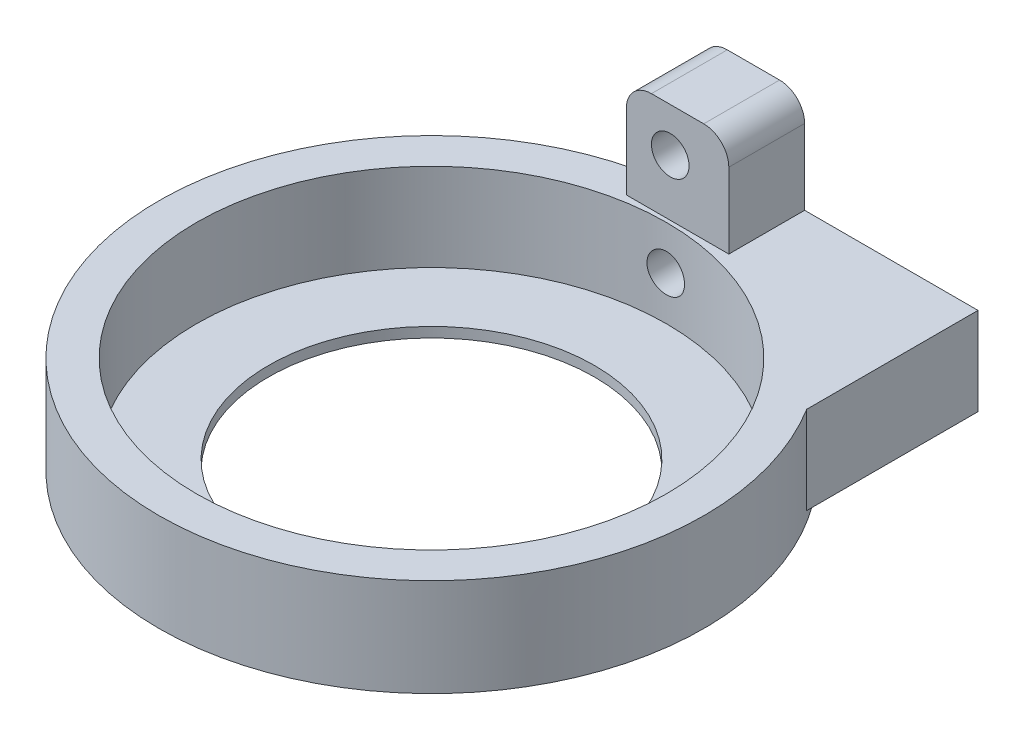
ISO-10303-21;
HEADER;
FILE_DESCRIPTION(('STEP AP214'),'2;1');
FILE_NAME('part.step','',(''),(''),'','','');
FILE_SCHEMA(('AUTOMOTIVE_DESIGN { 1 0 10303 214 1 1 1 1 }'));
ENDSEC;
DATA;
#1=APPLICATION_CONTEXT('core data for automotive mechanical design processes');
#2=APPLICATION_PROTOCOL_DEFINITION('international standard','automotive_design',2000,#1);
#3=PRODUCT_CONTEXT('',#1,'mechanical');
#4=PRODUCT('Part','Part','',(#3));
#5=PRODUCT_RELATED_PRODUCT_CATEGORY('part','',(#4));
#6=PRODUCT_DEFINITION_FORMATION('','',#4);
#7=PRODUCT_DEFINITION_CONTEXT('part definition',#1,'design');
#8=PRODUCT_DEFINITION('design','',#6,#7);
#9=PRODUCT_DEFINITION_SHAPE('','',#8);
#10=(LENGTH_UNIT() NAMED_UNIT(*) SI_UNIT(.MILLI.,.METRE.));
#11=(NAMED_UNIT(*) PLANE_ANGLE_UNIT() SI_UNIT($,.RADIAN.));
#12=(NAMED_UNIT(*) SI_UNIT($,.STERADIAN.) SOLID_ANGLE_UNIT());
#13=UNCERTAINTY_MEASURE_WITH_UNIT(LENGTH_MEASURE(1.E-05),#10,'distance_accuracy_value','');
#14=(GEOMETRIC_REPRESENTATION_CONTEXT(3) GLOBAL_UNCERTAINTY_ASSIGNED_CONTEXT((#13)) GLOBAL_UNIT_ASSIGNED_CONTEXT((#10,
#11,#12)) REPRESENTATION_CONTEXT('',''));
#15=CARTESIAN_POINT('',(0.,0.,0.));
#16=DIRECTION('',(0.,0.,1.));
#17=DIRECTION('',(1.,0.,0.));
#18=AXIS2_PLACEMENT_3D('',#15,#16,#17);
#19=CARTESIAN_POINT('',(0.,0.,0.));
#20=DIRECTION('',(0.,1.,0.));
#21=DIRECTION('',(0.,0.,-1.));
#22=AXIS2_PLACEMENT_3D('',#19,#20,#21);
#23=PLANE('',#22);
#24=CARTESIAN_POINT('',(0.,0.,0.));
#25=DIRECTION('',(0.,1.,0.));
#26=DIRECTION('',(0.,0.,1.));
#27=AXIS2_PLACEMENT_3D('',#24,#25,#26);
#28=CIRCLE('',#27,21.75);
#29=CARTESIAN_POINT('',(18.5,0.,-11.4373292336979));
#30=VERTEX_POINT('',#29);
#31=CARTESIAN_POINT('',(-3.5,0.,-21.4665437367081));
#32=VERTEX_POINT('',#31);
#33=EDGE_CURVE('E163',#30,#32,#28,.T.);
#34=ORIENTED_EDGE('',*,*,#33,.T.);
#35=DIRECTION('',(0.,0.,1.));
#36=VECTOR('',#35,1.);
#37=CARTESIAN_POINT('',(-3.5,0.,-25.1));
#38=LINE('',#37,#36);
#39=CARTESIAN_POINT('',(-3.5,0.,-25.1));
#40=VERTEX_POINT('',#39);
#41=EDGE_CURVE('E178',#40,#32,#38,.T.);
#42=ORIENTED_EDGE('',*,*,#41,.F.);
#43=DIRECTION('',(-1.,0.,0.));
#44=VECTOR('',#43,1.);
#45=CARTESIAN_POINT('',(3.5,0.,-25.1));
#46=LINE('',#45,#44);
#47=CARTESIAN_POINT('',(18.5,0.,-25.1));
#48=VERTEX_POINT('',#47);
#49=EDGE_CURVE('E185',#48,#40,#46,.T.);
#50=ORIENTED_EDGE('',*,*,#49,.F.);
#51=DIRECTION('',(0.,0.,1.));
#52=VECTOR('',#51,1.);
#53=CARTESIAN_POINT('',(18.5,0.,-25.1));
#54=LINE('',#53,#52);
#55=EDGE_CURVE('E154',#48,#30,#54,.T.);
#56=ORIENTED_EDGE('',*,*,#55,.T.);
#57=EDGE_LOOP('',(#34,#42,#50,#56));
#58=FACE_BOUND('',#57,.T.);
#59=ADVANCED_FACE('F41',(#58),#23,.F.);
#60=CARTESIAN_POINT('',(0.,7.,0.));
#61=DIRECTION('',(0.,1.,0.));
#62=DIRECTION('',(0.,0.,-1.));
#63=AXIS2_PLACEMENT_3D('',#60,#61,#62);
#64=PLANE('',#63);
#65=DIRECTION('',(0.,0.,-1.));
#66=VECTOR('',#65,1.);
#67=CARTESIAN_POINT('',(-3.5,7.,-25.1));
#68=LINE('',#67,#66);
#69=CARTESIAN_POINT('',(-3.5,7.,-19.0497576098352));
#70=VERTEX_POINT('',#69);
#71=CARTESIAN_POINT('',(-3.5,7.,-21.4665437367081));
#72=VERTEX_POINT('',#71);
#73=EDGE_CURVE('E135',#70,#72,#68,.T.);
#74=ORIENTED_EDGE('',*,*,#73,.T.);
#75=CARTESIAN_POINT('',(0.,7.,0.));
#76=DIRECTION('',(0.,-1.,0.));
#77=DIRECTION('',(0.,0.,-1.));
#78=AXIS2_PLACEMENT_3D('',#75,#76,#77);
#79=CIRCLE('',#78,21.75);
#80=CARTESIAN_POINT('',(18.5,7.,-11.4373292336979));
#81=VERTEX_POINT('',#80);
#82=EDGE_CURVE('E182',#81,#72,#79,.T.);
#83=ORIENTED_EDGE('',*,*,#82,.F.);
#84=DIRECTION('',(0.,0.,-1.));
#85=VECTOR('',#84,1.);
#86=CARTESIAN_POINT('',(18.5,7.,-25.1));
#87=LINE('',#86,#85);
#88=CARTESIAN_POINT('',(18.5,7.,-25.1));
#89=VERTEX_POINT('',#88);
#90=EDGE_CURVE('E157',#81,#89,#87,.T.);
#91=ORIENTED_EDGE('',*,*,#90,.T.);
#92=DIRECTION('',(-1.,0.,0.));
#93=VECTOR('',#92,1.);
#94=CARTESIAN_POINT('',(3.5,7.,-25.1));
#95=LINE('',#94,#93);
#96=CARTESIAN_POINT('',(4.67120690078326,7.,-25.1));
#97=VERTEX_POINT('',#96);
#98=EDGE_CURVE('E134',#89,#97,#95,.T.);
#99=ORIENTED_EDGE('',*,*,#98,.T.);
#100=DIRECTION('',(0.,0.,1.));
#101=VECTOR('',#100,1.);
#102=CARTESIAN_POINT('',(4.67120690078326,7.,-25.1));
#103=LINE('',#102,#101);
#104=CARTESIAN_POINT('',(4.67120690078326,7.,-19.0497576098352));
#105=VERTEX_POINT('',#104);
#106=EDGE_CURVE('E116',#97,#105,#103,.T.);
#107=ORIENTED_EDGE('',*,*,#106,.T.);
#108=DIRECTION('',(-1.,0.,0.));
#109=VECTOR('',#108,1.);
#110=CARTESIAN_POINT('',(-3.5,7.,-19.0497576098352));
#111=LINE('',#110,#109);
#112=EDGE_CURVE('E122',#105,#70,#111,.T.);
#113=ORIENTED_EDGE('',*,*,#112,.T.);
#114=EDGE_LOOP('',(#74,#83,#91,#99,#107,#113));
#115=FACE_BOUND('',#114,.T.);
#116=CARTESIAN_POINT('',(0.,7.,0.));
#117=DIRECTION('',(0.,-1.,0.));
#118=DIRECTION('',(0.,0.,-1.));
#119=AXIS2_PLACEMENT_3D('',#116,#117,#118);
#120=CIRCLE('',#119,18.75);
#121=CARTESIAN_POINT('',(0.,7.,-18.75));
#122=VERTEX_POINT('',#121);
#123=EDGE_CURVE('E175',#122,#122,#120,.T.);
#124=ORIENTED_EDGE('',*,*,#123,.T.);
#125=EDGE_LOOP('',(#124));
#126=FACE_BOUND('',#125,.T.);
#127=ADVANCED_FACE('F130',(#115,#126),#64,.T.);
#128=CARTESIAN_POINT('',(0.,7.,0.));
#129=DIRECTION('',(0.,-1.,0.));
#130=DIRECTION('',(0.,0.,1.));
#131=AXIS2_PLACEMENT_3D('',#128,#129,#130);
#132=CYLINDRICAL_SURFACE('',#131,21.75);
#133=ORIENTED_EDGE('',*,*,#82,.T.);
#134=DIRECTION('',(0.,-1.,0.));
#135=VECTOR('',#134,1.);
#136=CARTESIAN_POINT('',(-3.5,7.,-21.4665437367081));
#137=LINE('',#136,#135);
#138=EDGE_CURVE('E193',#72,#32,#137,.T.);
#139=ORIENTED_EDGE('',*,*,#138,.T.);
#140=ORIENTED_EDGE('',*,*,#33,.F.);
#141=DIRECTION('',(0.,1.,0.));
#142=VECTOR('',#141,1.);
#143=CARTESIAN_POINT('',(18.5,0.,-11.4373292336979));
#144=LINE('',#143,#142);
#145=EDGE_CURVE('E148',#30,#81,#144,.T.);
#146=ORIENTED_EDGE('',*,*,#145,.T.);
#147=EDGE_LOOP('',(#133,#139,#140,#146));
#148=FACE_BOUND('',#147,.T.);
#149=CARTESIAN_POINT('',(0.,-0.8,0.));
#150=DIRECTION('',(0.,1.,0.));
#151=DIRECTION('',(0.,0.,1.));
#152=AXIS2_PLACEMENT_3D('',#149,#150,#151);
#153=CIRCLE('',#152,21.75);
#154=CARTESIAN_POINT('',(0.,-0.8,21.75));
#155=VERTEX_POINT('',#154);
#156=EDGE_CURVE('E166',#155,#155,#153,.T.);
#157=ORIENTED_EDGE('',*,*,#156,.T.);
#158=EDGE_LOOP('',(#157));
#159=FACE_BOUND('',#158,.T.);
#160=ADVANCED_FACE('F215',(#148,#159),#132,.T.);
#161=CARTESIAN_POINT('',(-3.5,7.,-25.1));
#162=DIRECTION('',(-1.,0.,0.));
#163=DIRECTION('',(0.,0.,-1.));
#164=AXIS2_PLACEMENT_3D('',#161,#162,#163);
#165=PLANE('',#164);
#166=DIRECTION('',(0.,-1.,0.));
#167=VECTOR('',#166,1.);
#168=CARTESIAN_POINT('',(-3.5,7.,-25.1));
#169=LINE('',#168,#167);
#170=CARTESIAN_POINT('',(-3.5,13.,-25.1));
#171=VERTEX_POINT('',#170);
#172=EDGE_CURVE('E187',#171,#40,#169,.T.);
#173=ORIENTED_EDGE('',*,*,#172,.T.);
#174=ORIENTED_EDGE('',*,*,#41,.T.);
#175=ORIENTED_EDGE('',*,*,#138,.F.);
#176=ORIENTED_EDGE('',*,*,#73,.F.);
#177=DIRECTION('',(0.,-1.,0.));
#178=VECTOR('',#177,1.);
#179=CARTESIAN_POINT('',(-3.5,15.,-19.0497576098352));
#180=LINE('',#179,#178);
#181=CARTESIAN_POINT('',(-3.5,13.,-19.0497576098352));
#182=VERTEX_POINT('',#181);
#183=EDGE_CURVE('E119',#182,#70,#180,.T.);
#184=ORIENTED_EDGE('',*,*,#183,.F.);
#185=DIRECTION('',(0.,0.,-1.));
#186=VECTOR('',#185,1.);
#187=CARTESIAN_POINT('',(-3.5,13.,-19.0497576098352));
#188=LINE('',#187,#186);
#189=EDGE_CURVE('E242',#171,#182,#188,.F.);
#190=ORIENTED_EDGE('',*,*,#189,.F.);
#191=EDGE_LOOP('',(#173,#174,#175,#176,#184,#190));
#192=FACE_BOUND('',#191,.T.);
#193=ADVANCED_FACE('F221',(#192),#165,.T.);
#194=CARTESIAN_POINT('',(3.5,7.,-25.1));
#195=DIRECTION('',(0.,0.,-1.));
#196=DIRECTION('',(1.,0.,0.));
#197=AXIS2_PLACEMENT_3D('',#194,#195,#196);
#198=PLANE('',#197);
#199=CARTESIAN_POINT('',(0.,11.5,-25.1));
#200=DIRECTION('',(0.,0.,1.));
#201=DIRECTION('',(1.,0.,0.));
#202=AXIS2_PLACEMENT_3D('',#199,#200,#201);
#203=CIRCLE('',#202,1.5);
#204=CARTESIAN_POINT('',(1.5,11.5,-25.1));
#205=VERTEX_POINT('',#204);
#206=EDGE_CURVE('E248',#205,#205,#203,.T.);
#207=ORIENTED_EDGE('',*,*,#206,.T.);
#208=EDGE_LOOP('',(#207));
#209=FACE_BOUND('',#208,.T.);
#210=CARTESIAN_POINT('',(10.,3.5,-25.1));
#211=DIRECTION('',(0.,0.,1.));
#212=DIRECTION('',(1.,0.,0.));
#213=AXIS2_PLACEMENT_3D('',#210,#211,#212);
#214=CIRCLE('',#213,1.5);
#215=CARTESIAN_POINT('',(11.5,3.5,-25.1));
#216=VERTEX_POINT('',#215);
#217=EDGE_CURVE('E144',#216,#216,#214,.T.);
#218=ORIENTED_EDGE('',*,*,#217,.T.);
#219=EDGE_LOOP('',(#218));
#220=FACE_BOUND('',#219,.T.);
#221=DIRECTION('',(1.,0.,0.));
#222=VECTOR('',#221,1.);
#223=CARTESIAN_POINT('',(-3.5,15.,-25.1));
#224=LINE('',#223,#222);
#225=CARTESIAN_POINT('',(-1.5,15.,-25.1));
#226=VERTEX_POINT('',#225);
#227=CARTESIAN_POINT('',(2.67120690078326,15.,-25.1));
#228=VERTEX_POINT('',#227);
#229=EDGE_CURVE('E128',#226,#228,#224,.T.);
#230=ORIENTED_EDGE('',*,*,#229,.T.);
#231=CARTESIAN_POINT('',(2.67120690078326,13.,-25.1));
#232=DIRECTION('',(0.,0.,1.));
#233=DIRECTION('',(1.,0.,0.));
#234=AXIS2_PLACEMENT_3D('',#231,#232,#233);
#235=CIRCLE('',#234,2.);
#236=CARTESIAN_POINT('',(4.67120690078326,13.,-25.1));
#237=VERTEX_POINT('',#236);
#238=EDGE_CURVE('E491',#237,#228,#235,.T.);
#239=ORIENTED_EDGE('',*,*,#238,.F.);
#240=DIRECTION('',(0.,-1.,0.));
#241=VECTOR('',#240,1.);
#242=CARTESIAN_POINT('',(4.67120690078326,15.,-25.1));
#243=LINE('',#242,#241);
#244=EDGE_CURVE('E118',#237,#97,#243,.T.);
#245=ORIENTED_EDGE('',*,*,#244,.T.);
#246=ORIENTED_EDGE('',*,*,#98,.F.);
#247=DIRECTION('',(0.,-1.,0.));
#248=VECTOR('',#247,1.);
#249=CARTESIAN_POINT('',(18.5,7.,-25.1));
#250=LINE('',#249,#248);
#251=EDGE_CURVE('E152',#89,#48,#250,.T.);
#252=ORIENTED_EDGE('',*,*,#251,.T.);
#253=ORIENTED_EDGE('',*,*,#49,.T.);
#254=ORIENTED_EDGE('',*,*,#172,.F.);
#255=CARTESIAN_POINT('',(-1.5,13.,-25.1));
#256=DIRECTION('',(0.,0.,1.));
#257=DIRECTION('',(1.,0.,0.));
#258=AXIS2_PLACEMENT_3D('',#255,#256,#257);
#259=CIRCLE('',#258,2.);
#260=EDGE_CURVE('E487',#226,#171,#259,.T.);
#261=ORIENTED_EDGE('',*,*,#260,.F.);
#262=EDGE_LOOP('',(#230,#239,#245,#246,#252,#253,#254,#261));
#263=FACE_BOUND('',#262,.T.);
#264=CARTESIAN_POINT('',(0.,3.5,-25.1));
#265=DIRECTION('',(0.,0.,1.));
#266=DIRECTION('',(1.,0.,0.));
#267=AXIS2_PLACEMENT_3D('',#264,#265,#266);
#268=CIRCLE('',#267,1.5);
#269=CARTESIAN_POINT('',(1.5,3.5,-25.1));
#270=VERTEX_POINT('',#269);
#271=EDGE_CURVE('E169',#270,#270,#268,.T.);
#272=ORIENTED_EDGE('',*,*,#271,.T.);
#273=EDGE_LOOP('',(#272));
#274=FACE_BOUND('',#273,.T.);
#275=ADVANCED_FACE('F211',(#209,#220,#263,#274),#198,.T.);
#276=CARTESIAN_POINT('',(0.,7.,0.));
#277=DIRECTION('',(0.,-1.,0.));
#278=DIRECTION('',(0.,0.,1.));
#279=AXIS2_PLACEMENT_3D('',#276,#277,#278);
#280=CYLINDRICAL_SURFACE('',#279,18.75);
#281=CARTESIAN_POINT('',(1.5,3.5,-18.6899036915657));
#282=CARTESIAN_POINT('',(1.49999632062772,3.41588910974437,-18.6899044892014));
#283=CARTESIAN_POINT('',(1.49290156215183,3.3317206652062,-18.6904775942158));
#284=CARTESIAN_POINT('',(1.46470318774386,3.16571175768858,-18.6927081206783));
#285=CARTESIAN_POINT('',(1.44358362109166,3.08387405616433,-18.6943667767162));
#286=CARTESIAN_POINT('',(1.38794959023862,2.92495508136651,-18.6985793452206));
#287=CARTESIAN_POINT('',(1.35344262614257,2.84787117282067,-18.7011327563356));
#288=CARTESIAN_POINT('',(1.27202646042832,2.70060821925846,-18.7068465005001));
#289=CARTESIAN_POINT('',(1.22511994393665,2.630427683824,-18.7100067021084));
#290=CARTESIAN_POINT('',(1.12011551831489,2.49877819168836,-18.7165863916315));
#291=CARTESIAN_POINT('',(1.06199424933048,2.43732789187484,-18.7200064115608));
#292=CARTESIAN_POINT('',(0.936259445760343,2.32504341460093,-18.7267155033906));
#293=CARTESIAN_POINT('',(0.868645500088394,2.27420969713547,-18.7300045696121));
#294=CARTESIAN_POINT('',(0.725734168475946,2.18453992472742,-18.7360861453358));
#295=CARTESIAN_POINT('',(0.650426681655086,2.14571991903267,-18.738877988498));
#296=CARTESIAN_POINT('',(0.494336491088885,2.08128219450257,-18.7436448358792));
#297=CARTESIAN_POINT('',(0.413553876517281,2.05566426070272,-18.745619853398));
#298=CARTESIAN_POINT('',(0.248991495760869,2.01841132760336,-18.7485268054688));
#299=CARTESIAN_POINT('',(0.165218575252358,2.00674626571047,-18.7494609822974));
#300=CARTESIAN_POINT('',(-0.00310101422522166,1.99763728747693,-18.7501885880184));
#301=CARTESIAN_POINT('',(-0.0876476697940369,2.00019312530925,-18.7499820366297));
#302=CARTESIAN_POINT('',(-0.254910958845742,2.01942877416144,-18.7484533122186));
#303=CARTESIAN_POINT('',(-0.337631336820587,2.03607625616637,-18.7471336928186));
#304=CARTESIAN_POINT('',(-0.499099950189813,2.08297238129014,-18.7435302217384));
#305=CARTESIAN_POINT('',(-0.577848150305161,2.11322114518559,-18.7412463614959));
#306=CARTESIAN_POINT('',(-0.729240075628612,2.18649731782168,-18.7359669873138));
#307=CARTESIAN_POINT('',(-0.801876748665349,2.22953923615441,-18.7329706660993));
#308=CARTESIAN_POINT('',(-0.938906754389632,2.32716937813201,-18.7266031809033));
#309=CARTESIAN_POINT('',(-1.00329993315168,2.38175781732721,-18.7232320099247));
#310=CARTESIAN_POINT('',(-1.12220402922705,2.50111371219672,-18.716482638835));
#311=CARTESIAN_POINT('',(-1.17668675797546,2.56590925405083,-18.7131044454878));
#312=CARTESIAN_POINT('',(-1.27400569041641,2.70374207490187,-18.7067312907922));
#313=CARTESIAN_POINT('',(-1.31684188556444,2.77677935994532,-18.7037363297249));
#314=CARTESIAN_POINT('',(-1.38965054864154,2.92904186429338,-18.6984681334495));
#315=CARTESIAN_POINT('',(-1.41962160308561,3.00826776240737,-18.6961949775527));
#316=CARTESIAN_POINT('',(-1.46582859989257,3.17064933913142,-18.6926292502436));
#317=CARTESIAN_POINT('',(-1.48206480809471,3.25380494164879,-18.6913366598524));
#318=CARTESIAN_POINT('',(-1.50030564278629,3.4214389223715,-18.6898814380755));
#319=CARTESIAN_POINT('',(-1.50234955607957,3.50591299971711,-18.6897156874231));
#320=CARTESIAN_POINT('',(-1.49225064585172,3.67400262104635,-18.690524676209));
#321=CARTESIAN_POINT('',(-1.48010794413208,3.75761817239478,-18.6914994058556));
#322=CARTESIAN_POINT('',(-1.44201322164018,3.92150472101421,-18.6944766801575));
#323=CARTESIAN_POINT('',(-1.41607949196744,4.00177999680187,-18.6964778632987));
#324=CARTESIAN_POINT('',(-1.35115745890298,4.15683972413565,-18.7012814234103));
#325=CARTESIAN_POINT('',(-1.31216896221481,4.23162409436024,-18.7040838122436));
#326=CARTESIAN_POINT('',(-1.22214454706965,4.373759059463,-18.7101815822911));
#327=CARTESIAN_POINT('',(-1.17108242281578,4.44109300986021,-18.7134780300796));
#328=CARTESIAN_POINT('',(-1.05839811840015,4.5662476479122,-18.7201888557784));
#329=CARTESIAN_POINT('',(-0.996775770633618,4.62406818454792,-18.7236032355598));
#330=CARTESIAN_POINT('',(-0.864550602263586,4.72868853250665,-18.7301744660023));
#331=CARTESIAN_POINT('',(-0.793927565253147,4.77546283652398,-18.7333307098241));
#332=CARTESIAN_POINT('',(-0.645806640765806,4.85648803992158,-18.7390213036078));
#333=CARTESIAN_POINT('',(-0.568308817352759,4.89073905598699,-18.7415556593639));
#334=CARTESIAN_POINT('',(-0.408730022480179,4.94570151548968,-18.7457141148762));
#335=CARTESIAN_POINT('',(-0.326654535286603,4.96642879824313,-18.7473392791795));
#336=CARTESIAN_POINT('',(-0.160174833719194,4.99380720003187,-18.7495005498768));
#337=CARTESIAN_POINT('',(-0.0757706596510529,5.00045856254326,-18.7500366751083));
#338=CARTESIAN_POINT('',(0.0927188866521085,4.99949357241986,-18.7499594956931));
#339=CARTESIAN_POINT('',(0.176804491059185,4.99191700058234,-18.7493493958487));
#340=CARTESIAN_POINT('',(0.342505049325764,4.96279408533884,-18.7470546664287));
#341=CARTESIAN_POINT('',(0.424119999621,4.94124772178048,-18.7453700353031));
#342=CARTESIAN_POINT('',(0.58256563894844,4.88480677611825,-18.7411153164152));
#343=CARTESIAN_POINT('',(0.6593965525984,4.8499128212543,-18.7385452702617));
#344=CARTESIAN_POINT('',(0.806115934271487,4.76777187152803,-18.7328074295552));
#345=CARTESIAN_POINT('',(0.8760045245382,4.72052509423304,-18.7296396455302));
#346=CARTESIAN_POINT('',(1.00705879886138,4.61487049786707,-18.7230514806532));
#347=CARTESIAN_POINT('',(1.06820077293534,4.55643330967203,-18.7196304499822));
#348=CARTESIAN_POINT('',(1.17983224819666,4.43010829215942,-18.7129268703636));
#349=CARTESIAN_POINT('',(1.23031916134281,4.36221817342083,-18.709644355215));
#350=CARTESIAN_POINT('',(1.31927004620408,4.21879254913323,-18.7035831840147));
#351=CARTESIAN_POINT('',(1.35771272607774,4.14324381313022,-18.7008054238702));
#352=CARTESIAN_POINT('',(1.42131855200279,3.98679387767989,-18.6960792751499));
#353=CARTESIAN_POINT('',(1.44649701682099,3.90589897459956,-18.6941299303474));
#354=CARTESIAN_POINT('',(1.47642337958161,3.77043630193827,-18.691784377361));
#355=CARTESIAN_POINT('',(1.48525291732771,3.71674059854125,-18.6910823459044));
#356=CARTESIAN_POINT('',(1.49704240943925,3.60870461027899,-18.6901417457999));
#357=CARTESIAN_POINT('',(1.5000023781296,3.55436432698718,-18.6899031760209));
#358=CARTESIAN_POINT('',(1.5,3.5,-18.6899036915657));
#359=B_SPLINE_CURVE_WITH_KNOTS('',3,(#281,#282,#283,#284,#285,#286,#287,#288,#289,#290,#291,
#292,#293,#294,#295,#296,#297,#298,#299,#300,#301,#302,#303,#304,#305,#306,#307,#308,#309,#310,
#311,#312,#313,#314,#315,#316,#317,#318,#319,#320,#321,#322,#323,#324,#325,#326,#327,#328,#329,
#330,#331,#332,#333,#334,#335,#336,#337,#338,#339,#340,#341,#342,#343,#344,#345,#346,#347,#348,
#349,#350,#351,#352,#353,#354,#355,#356,#357,#358),.UNSPECIFIED.,.T.,.F.,(4,2,2,2,2,2,2,2,2,2,2,
2,2,2,2,2,2,2,2,2,2,2,2,2,2,2,2,2,2,2,2,2,2,2,2,2,2,2,4),(0.,0.25213418203791,0.50455561402385,
0.756835834120728,1.00906146755583,1.26181826116902,1.51458600394927,1.7676899785965,
2.02078983191417,2.27334337309686,2.52589254857181,2.77786389180794,3.02983747254223,
3.28209793140011,3.53436309986935,3.78733494058949,4.0403069669025,4.29330677998519,
4.54630169612057,4.79859599700462,5.05088813179099,5.30284648195618,5.55480856292754,
5.80732263043169,6.05984070604075,6.31293630132195,6.56602953833693,6.8188258119051,
7.07161771273227,7.32370386856552,7.5757903880512,7.82786506275495,8.07993529802616,
8.33267638790938,8.5854787963961,8.83872562068804,9.09167932690653,9.25464441416333,
9.41760910369755),.UNSPECIFIED.);
#360=CARTESIAN_POINT('',(1.5,3.5,-18.6899036915657));
#361=VERTEX_POINT('',#360);
#362=EDGE_CURVE('E174',#361,#361,#359,.T.);
#363=ORIENTED_EDGE('',*,*,#362,.T.);
#364=EDGE_LOOP('',(#363));
#365=FACE_BOUND('',#364,.T.);
#366=ORIENTED_EDGE('',*,*,#123,.F.);
#367=EDGE_LOOP('',(#366));
#368=FACE_BOUND('',#367,.T.);
#369=CARTESIAN_POINT('',(0.,0.,0.));
#370=DIRECTION('',(0.,-1.,0.));
#371=DIRECTION('',(0.,0.,-1.));
#372=AXIS2_PLACEMENT_3D('',#369,#370,#371);
#373=CIRCLE('',#372,18.75);
#374=CARTESIAN_POINT('',(0.,0.,-18.75));
#375=VERTEX_POINT('',#374);
#376=EDGE_CURVE('E179',#375,#375,#373,.T.);
#377=ORIENTED_EDGE('',*,*,#376,.T.);
#378=EDGE_LOOP('',(#377));
#379=FACE_BOUND('',#378,.T.);
#380=ADVANCED_FACE('F207',(#365,#368,#379),#280,.F.);
#381=CARTESIAN_POINT('',(0.,3.5,-18.1));
#382=DIRECTION('',(0.,0.,-1.));
#383=DIRECTION('',(1.,0.,0.));
#384=AXIS2_PLACEMENT_3D('',#381,#382,#383);
#385=CYLINDRICAL_SURFACE('',#384,1.5);
#386=ORIENTED_EDGE('',*,*,#362,.F.);
#387=EDGE_LOOP('',(#386));
#388=FACE_BOUND('',#387,.T.);
#389=ORIENTED_EDGE('',*,*,#271,.F.);
#390=EDGE_LOOP('',(#389));
#391=FACE_BOUND('',#390,.T.);
#392=ADVANCED_FACE('F204',(#388,#391),#385,.F.);
#393=CARTESIAN_POINT('',(0.,0.,0.));
#394=DIRECTION('',(0.,-1.,0.));
#395=DIRECTION('',(0.,0.,1.));
#396=AXIS2_PLACEMENT_3D('',#393,#394,#395);
#397=PLANE('',#396);
#398=CARTESIAN_POINT('',(0.,0.,0.));
#399=DIRECTION('',(0.,1.,0.));
#400=DIRECTION('',(0.,0.,1.));
#401=AXIS2_PLACEMENT_3D('',#398,#399,#400);
#402=CIRCLE('',#401,13.);
#403=CARTESIAN_POINT('',(0.,0.,13.));
#404=VERTEX_POINT('',#403);
#405=EDGE_CURVE('E159',#404,#404,#402,.T.);
#406=ORIENTED_EDGE('',*,*,#405,.F.);
#407=EDGE_LOOP('',(#406));
#408=FACE_BOUND('',#407,.T.);
#409=ORIENTED_EDGE('',*,*,#376,.F.);
#410=EDGE_LOOP('',(#409));
#411=FACE_BOUND('',#410,.T.);
#412=ADVANCED_FACE('F282',(#408,#411),#397,.F.);
#413=CARTESIAN_POINT('',(0.,-0.8,0.));
#414=DIRECTION('',(0.,-1.,0.));
#415=DIRECTION('',(0.,0.,1.));
#416=AXIS2_PLACEMENT_3D('',#413,#414,#415);
#417=PLANE('',#416);
#418=ORIENTED_EDGE('',*,*,#156,.F.);
#419=EDGE_LOOP('',(#418));
#420=FACE_BOUND('',#419,.T.);
#421=CARTESIAN_POINT('',(0.,-0.8,0.));
#422=DIRECTION('',(0.,1.,0.));
#423=DIRECTION('',(0.,0.,1.));
#424=AXIS2_PLACEMENT_3D('',#421,#422,#423);
#425=CIRCLE('',#424,13.);
#426=CARTESIAN_POINT('',(0.,-0.8,13.));
#427=VERTEX_POINT('',#426);
#428=EDGE_CURVE('E160',#427,#427,#425,.T.);
#429=ORIENTED_EDGE('',*,*,#428,.T.);
#430=EDGE_LOOP('',(#429));
#431=FACE_BOUND('',#430,.T.);
#432=ADVANCED_FACE('F279',(#420,#431),#417,.T.);
#433=CARTESIAN_POINT('',(0.,-0.8,0.));
#434=DIRECTION('',(0.,1.,0.));
#435=DIRECTION('',(0.,0.,-1.));
#436=AXIS2_PLACEMENT_3D('',#433,#434,#435);
#437=CYLINDRICAL_SURFACE('',#436,13.);
#438=ORIENTED_EDGE('',*,*,#428,.F.);
#439=EDGE_LOOP('',(#438));
#440=FACE_BOUND('',#439,.T.);
#441=ORIENTED_EDGE('',*,*,#405,.T.);
#442=EDGE_LOOP('',(#441));
#443=FACE_BOUND('',#442,.T.);
#444=ADVANCED_FACE('F275',(#440,#443),#437,.F.);
#445=CARTESIAN_POINT('',(18.5,0.,0.));
#446=DIRECTION('',(1.,0.,0.));
#447=DIRECTION('',(0.,0.,1.));
#448=AXIS2_PLACEMENT_3D('',#445,#446,#447);
#449=PLANE('',#448);
#450=ORIENTED_EDGE('',*,*,#251,.F.);
#451=ORIENTED_EDGE('',*,*,#90,.F.);
#452=ORIENTED_EDGE('',*,*,#145,.F.);
#453=ORIENTED_EDGE('',*,*,#55,.F.);
#454=EDGE_LOOP('',(#450,#451,#452,#453));
#455=FACE_BOUND('',#454,.T.);
#456=ADVANCED_FACE('F271',(#455),#449,.T.);
#457=CARTESIAN_POINT('',(10.,3.5,-19.1));
#458=DIRECTION('',(0.,0.,-1.));
#459=DIRECTION('',(1.,0.,0.));
#460=AXIS2_PLACEMENT_3D('',#457,#458,#459);
#461=CYLINDRICAL_SURFACE('',#460,1.5);
#462=CARTESIAN_POINT('',(10.,3.5,-19.1));
#463=DIRECTION('',(0.,0.,1.));
#464=DIRECTION('',(1.,0.,0.));
#465=AXIS2_PLACEMENT_3D('',#462,#463,#464);
#466=CIRCLE('',#465,1.5);
#467=CARTESIAN_POINT('',(11.5,3.5,-19.1));
#468=VERTEX_POINT('',#467);
#469=EDGE_CURVE('E145',#468,#468,#466,.T.);
#470=ORIENTED_EDGE('',*,*,#469,.T.);
#471=EDGE_LOOP('',(#470));
#472=FACE_BOUND('',#471,.T.);
#473=ORIENTED_EDGE('',*,*,#217,.F.);
#474=EDGE_LOOP('',(#473));
#475=FACE_BOUND('',#474,.T.);
#476=ADVANCED_FACE('F267',(#472,#475),#461,.F.);
#477=CARTESIAN_POINT('',(10.,3.5,-19.1));
#478=DIRECTION('',(0.,0.,-1.));
#479=DIRECTION('',(1.,0.,0.));
#480=AXIS2_PLACEMENT_3D('',#477,#478,#479);
#481=PLANE('',#480);
#482=ORIENTED_EDGE('',*,*,#469,.F.);
#483=EDGE_LOOP('',(#482));
#484=FACE_BOUND('',#483,.T.);
#485=ADVANCED_FACE('F262',(#484),#481,.T.);
#486=CARTESIAN_POINT('',(4.67120690078326,15.,-25.1));
#487=DIRECTION('',(-1.,0.,0.));
#488=DIRECTION('',(0.,0.,-1.));
#489=AXIS2_PLACEMENT_3D('',#486,#487,#488);
#490=PLANE('',#489);
#491=DIRECTION('',(0.,-1.,0.));
#492=VECTOR('',#491,1.);
#493=CARTESIAN_POINT('',(4.67120690078326,15.,-19.0497576098352));
#494=LINE('',#493,#492);
#495=CARTESIAN_POINT('',(4.67120690078326,13.,-19.0497576098352));
#496=VERTEX_POINT('',#495);
#497=EDGE_CURVE('E111',#496,#105,#494,.T.);
#498=ORIENTED_EDGE('',*,*,#497,.T.);
#499=ORIENTED_EDGE('',*,*,#106,.F.);
#500=ORIENTED_EDGE('',*,*,#244,.F.);
#501=DIRECTION('',(0.,0.,1.));
#502=VECTOR('',#501,1.);
#503=CARTESIAN_POINT('',(4.67120690078326,13.,-25.1));
#504=LINE('',#503,#502);
#505=EDGE_CURVE('E11',#496,#237,#504,.F.);
#506=ORIENTED_EDGE('',*,*,#505,.F.);
#507=EDGE_LOOP('',(#498,#499,#500,#506));
#508=FACE_BOUND('',#507,.T.);
#509=ADVANCED_FACE('F113',(#508),#490,.F.);
#510=CARTESIAN_POINT('',(-3.5,15.,-19.0497576098352));
#511=DIRECTION('',(0.,0.,-1.));
#512=DIRECTION('',(1.,0.,0.));
#513=AXIS2_PLACEMENT_3D('',#510,#511,#512);
#514=PLANE('',#513);
#515=CARTESIAN_POINT('',(0.,11.5,-19.0497576098352));
#516=DIRECTION('',(0.,0.,1.));
#517=DIRECTION('',(1.,0.,0.));
#518=AXIS2_PLACEMENT_3D('',#515,#516,#517);
#519=CIRCLE('',#518,1.5);
#520=CARTESIAN_POINT('',(1.5,11.5,-19.0497576098352));
#521=VERTEX_POINT('',#520);
#522=EDGE_CURVE('E137',#521,#521,#519,.T.);
#523=ORIENTED_EDGE('',*,*,#522,.F.);
#524=EDGE_LOOP('',(#523));
#525=FACE_BOUND('',#524,.T.);
#526=ORIENTED_EDGE('',*,*,#183,.T.);
#527=ORIENTED_EDGE('',*,*,#112,.F.);
#528=ORIENTED_EDGE('',*,*,#497,.F.);
#529=CARTESIAN_POINT('',(2.67120690078326,13.,-19.0497576098352));
#530=DIRECTION('',(0.,0.,1.));
#531=DIRECTION('',(1.,0.,0.));
#532=AXIS2_PLACEMENT_3D('',#529,#530,#531);
#533=CIRCLE('',#532,2.);
#534=CARTESIAN_POINT('',(2.67120690078326,15.,-19.0497576098352));
#535=VERTEX_POINT('',#534);
#536=EDGE_CURVE('E55',#535,#496,#533,.F.);
#537=ORIENTED_EDGE('',*,*,#536,.F.);
#538=DIRECTION('',(-1.,0.,0.));
#539=VECTOR('',#538,1.);
#540=CARTESIAN_POINT('',(-3.5,15.,-19.0497576098352));
#541=LINE('',#540,#539);
#542=CARTESIAN_POINT('',(-1.5,15.,-19.0497576098352));
#543=VERTEX_POINT('',#542);
#544=EDGE_CURVE('E141',#535,#543,#541,.T.);
#545=ORIENTED_EDGE('',*,*,#544,.T.);
#546=CARTESIAN_POINT('',(-1.5,13.,-19.0497576098352));
#547=DIRECTION('',(0.,0.,1.));
#548=DIRECTION('',(1.,0.,0.));
#549=AXIS2_PLACEMENT_3D('',#546,#547,#548);
#550=CIRCLE('',#549,2.);
#551=EDGE_CURVE('E49',#182,#543,#550,.F.);
#552=ORIENTED_EDGE('',*,*,#551,.F.);
#553=EDGE_LOOP('',(#526,#527,#528,#537,#545,#552));
#554=FACE_BOUND('',#553,.T.);
#555=ADVANCED_FACE('F123',(#525,#554),#514,.F.);
#556=CARTESIAN_POINT('',(0.,15.,0.));
#557=DIRECTION('',(0.,-1.,0.));
#558=DIRECTION('',(0.,0.,1.));
#559=AXIS2_PLACEMENT_3D('',#556,#557,#558);
#560=PLANE('',#559);
#561=ORIENTED_EDGE('',*,*,#544,.F.);
#562=DIRECTION('',(0.,0.,1.));
#563=VECTOR('',#562,1.);
#564=CARTESIAN_POINT('',(2.67120690078326,15.,0.));
#565=LINE('',#564,#563);
#566=EDGE_CURVE('E195',#228,#535,#565,.T.);
#567=ORIENTED_EDGE('',*,*,#566,.F.);
#568=ORIENTED_EDGE('',*,*,#229,.F.);
#569=DIRECTION('',(0.,0.,-1.));
#570=VECTOR('',#569,1.);
#571=CARTESIAN_POINT('',(-1.5,15.,-25.1));
#572=LINE('',#571,#570);
#573=EDGE_CURVE('E239',#543,#226,#572,.T.);
#574=ORIENTED_EDGE('',*,*,#573,.F.);
#575=EDGE_LOOP('',(#561,#567,#568,#574));
#576=FACE_BOUND('',#575,.T.);
#577=ADVANCED_FACE('F236',(#576),#560,.F.);
#578=CARTESIAN_POINT('',(0.,11.5,-15.1));
#579=DIRECTION('',(0.,0.,-1.));
#580=DIRECTION('',(1.,0.,0.));
#581=AXIS2_PLACEMENT_3D('',#578,#579,#580);
#582=CYLINDRICAL_SURFACE('',#581,1.5);
#583=ORIENTED_EDGE('',*,*,#206,.F.);
#584=EDGE_LOOP('',(#583));
#585=FACE_BOUND('',#584,.T.);
#586=ORIENTED_EDGE('',*,*,#522,.T.);
#587=EDGE_LOOP('',(#586));
#588=FACE_BOUND('',#587,.T.);
#589=ADVANCED_FACE('F230',(#585,#588),#582,.F.);
#590=CARTESIAN_POINT('',(-1.5,13.,0.));
#591=DIRECTION('',(0.,0.,1.));
#592=DIRECTION('',(-1.,0.,0.));
#593=AXIS2_PLACEMENT_3D('',#590,#591,#592);
#594=CYLINDRICAL_SURFACE('',#593,2.);
#595=ORIENTED_EDGE('',*,*,#551,.T.);
#596=ORIENTED_EDGE('',*,*,#573,.T.);
#597=ORIENTED_EDGE('',*,*,#260,.T.);
#598=ORIENTED_EDGE('',*,*,#189,.T.);
#599=EDGE_LOOP('',(#595,#596,#597,#598));
#600=FACE_BOUND('',#599,.T.);
#601=ADVANCED_FACE('F228',(#600),#594,.T.);
#602=CARTESIAN_POINT('',(2.67120690078326,13.,0.));
#603=DIRECTION('',(0.,0.,1.));
#604=DIRECTION('',(-1.,0.,0.));
#605=AXIS2_PLACEMENT_3D('',#602,#603,#604);
#606=CYLINDRICAL_SURFACE('',#605,2.);
#607=ORIENTED_EDGE('',*,*,#238,.T.);
#608=ORIENTED_EDGE('',*,*,#566,.T.);
#609=ORIENTED_EDGE('',*,*,#536,.T.);
#610=ORIENTED_EDGE('',*,*,#505,.T.);
#611=EDGE_LOOP('',(#607,#608,#609,#610));
#612=FACE_BOUND('',#611,.T.);
#613=ADVANCED_FACE('F43',(#612),#606,.T.);
#614=CLOSED_SHELL('',(#59,#127,#160,#193,#275,#380,#392,#412,#432,#444,#456,#476,#485,#509,#555,
#577,#589,#601,#613));
#615=MANIFOLD_SOLID_BREP('B2',#614);
#616=ADVANCED_BREP_SHAPE_REPRESENTATION('',(#18,#615),#14);
#617=SHAPE_DEFINITION_REPRESENTATION(#9,#616);
ENDSEC;
END-ISO-10303-21;
